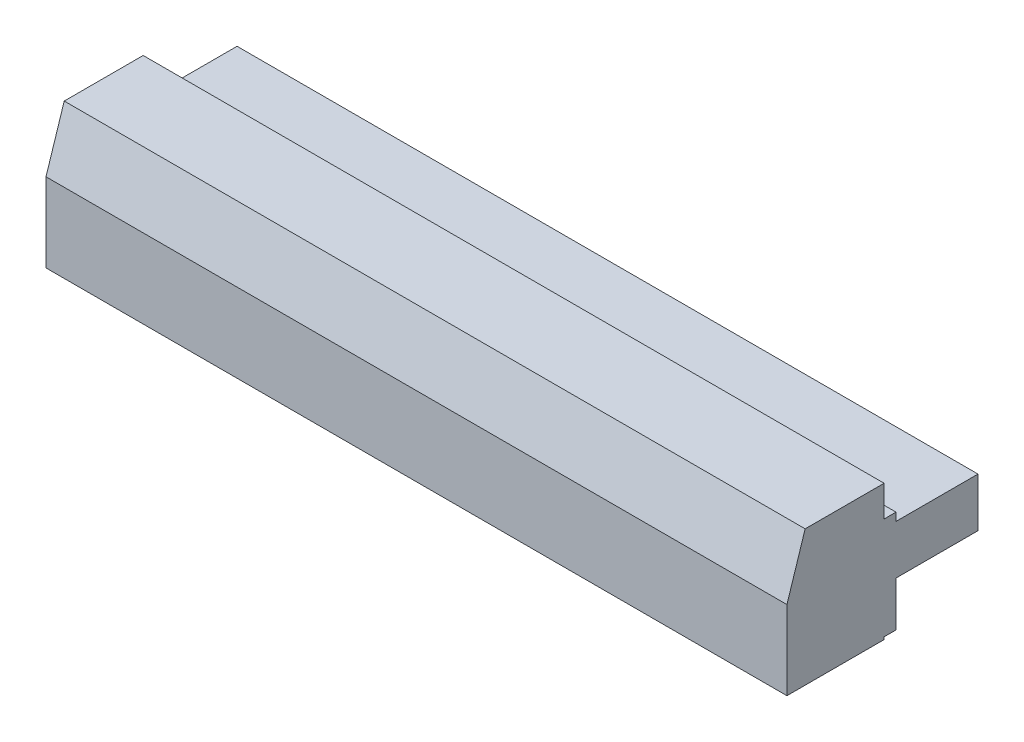
ISO-10303-21;
HEADER;
FILE_DESCRIPTION(('STEP AP214'),'2;1');
FILE_NAME('part.step','',(''),(''),'','','');
FILE_SCHEMA(('AUTOMOTIVE_DESIGN { 1 0 10303 214 1 1 1 1 }'));
ENDSEC;
DATA;
#1=APPLICATION_CONTEXT('core data for automotive mechanical design processes');
#2=APPLICATION_PROTOCOL_DEFINITION('international standard','automotive_design',2000,#1);
#3=PRODUCT_CONTEXT('',#1,'mechanical');
#4=PRODUCT('Part','Part','',(#3));
#5=PRODUCT_RELATED_PRODUCT_CATEGORY('part','',(#4));
#6=PRODUCT_DEFINITION_FORMATION('','',#4);
#7=PRODUCT_DEFINITION_CONTEXT('part definition',#1,'design');
#8=PRODUCT_DEFINITION('design','',#6,#7);
#9=PRODUCT_DEFINITION_SHAPE('','',#8);
#10=(LENGTH_UNIT() NAMED_UNIT(*) SI_UNIT(.MILLI.,.METRE.));
#11=(NAMED_UNIT(*) PLANE_ANGLE_UNIT() SI_UNIT($,.RADIAN.));
#12=(NAMED_UNIT(*) SI_UNIT($,.STERADIAN.) SOLID_ANGLE_UNIT());
#13=UNCERTAINTY_MEASURE_WITH_UNIT(LENGTH_MEASURE(1.E-05),#10,'distance_accuracy_value','');
#14=(GEOMETRIC_REPRESENTATION_CONTEXT(3) GLOBAL_UNCERTAINTY_ASSIGNED_CONTEXT((#13)) GLOBAL_UNIT_ASSIGNED_CONTEXT((#10,
#11,#12)) REPRESENTATION_CONTEXT('',''));
#15=CARTESIAN_POINT('',(0.,0.,0.));
#16=DIRECTION('',(0.,0.,1.));
#17=DIRECTION('',(1.,0.,0.));
#18=AXIS2_PLACEMENT_3D('',#15,#16,#17);
#19=CARTESIAN_POINT('',(61.,0.,-0.98));
#20=DIRECTION('',(0.,1.,0.));
#21=DIRECTION('',(0.,0.,1.));
#22=AXIS2_PLACEMENT_3D('',#19,#20,#21);
#23=PLANE('',#22);
#24=DIRECTION('',(0.,0.,-1.));
#25=VECTOR('',#24,1.);
#26=CARTESIAN_POINT('',(0.,0.,-0.98));
#27=LINE('',#26,#25);
#28=CARTESIAN_POINT('',(0.,0.,0.));
#29=VERTEX_POINT('',#28);
#30=CARTESIAN_POINT('',(0.,0.,-0.98));
#31=VERTEX_POINT('',#30);
#32=EDGE_CURVE('E162',#29,#31,#27,.T.);
#33=ORIENTED_EDGE('',*,*,#32,.T.);
#34=DIRECTION('',(-1.,0.,0.));
#35=VECTOR('',#34,1.);
#36=CARTESIAN_POINT('',(61.,0.,-0.98));
#37=LINE('',#36,#35);
#38=CARTESIAN_POINT('',(61.,0.,-0.98));
#39=VERTEX_POINT('',#38);
#40=EDGE_CURVE('E11',#39,#31,#37,.T.);
#41=ORIENTED_EDGE('',*,*,#40,.F.);
#42=DIRECTION('',(0.,0.,-1.));
#43=VECTOR('',#42,1.);
#44=CARTESIAN_POINT('',(61.,0.,-0.98));
#45=LINE('',#44,#43);
#46=CARTESIAN_POINT('',(61.,0.,0.));
#47=VERTEX_POINT('',#46);
#48=EDGE_CURVE('E186',#47,#39,#45,.T.);
#49=ORIENTED_EDGE('',*,*,#48,.F.);
#50=DIRECTION('',(-1.,0.,0.));
#51=VECTOR('',#50,1.);
#52=CARTESIAN_POINT('',(61.,0.,0.));
#53=LINE('',#52,#51);
#54=EDGE_CURVE('E158',#47,#29,#53,.T.);
#55=ORIENTED_EDGE('',*,*,#54,.T.);
#56=EDGE_LOOP('',(#33,#41,#49,#55));
#57=FACE_BOUND('',#56,.T.);
#58=ADVANCED_FACE('F36',(#57),#23,.F.);
#59=CARTESIAN_POINT('',(61.,3.7,-0.979999999999999));
#60=DIRECTION('',(0.,0.,1.));
#61=DIRECTION('',(0.,-1.,0.));
#62=AXIS2_PLACEMENT_3D('',#59,#60,#61);
#63=PLANE('',#62);
#64=DIRECTION('',(0.,1.,0.));
#65=VECTOR('',#64,1.);
#66=CARTESIAN_POINT('',(0.,3.7,-0.979999999999999));
#67=LINE('',#66,#65);
#68=CARTESIAN_POINT('',(0.,3.7,-0.979999999999999));
#69=VERTEX_POINT('',#68);
#70=EDGE_CURVE('E165',#31,#69,#67,.T.);
#71=ORIENTED_EDGE('',*,*,#70,.T.);
#72=DIRECTION('',(-1.,0.,0.));
#73=VECTOR('',#72,1.);
#74=CARTESIAN_POINT('',(61.,3.7,-0.979999999999999));
#75=LINE('',#74,#73);
#76=CARTESIAN_POINT('',(61.,3.7,-0.979999999999999));
#77=VERTEX_POINT('',#76);
#78=EDGE_CURVE('E44',#77,#69,#75,.T.);
#79=ORIENTED_EDGE('',*,*,#78,.F.);
#80=DIRECTION('',(0.,1.,0.));
#81=VECTOR('',#80,1.);
#82=CARTESIAN_POINT('',(61.,3.7,-0.979999999999999));
#83=LINE('',#82,#81);
#84=EDGE_CURVE('E110',#39,#77,#83,.T.);
#85=ORIENTED_EDGE('',*,*,#84,.F.);
#86=ORIENTED_EDGE('',*,*,#40,.T.);
#87=EDGE_LOOP('',(#71,#79,#85,#86));
#88=FACE_BOUND('',#87,.T.);
#89=ADVANCED_FACE('F269',(#88),#63,.F.);
#90=CARTESIAN_POINT('',(61.,3.7,-7.73));
#91=DIRECTION('',(0.,1.,0.));
#92=DIRECTION('',(0.,0.,1.));
#93=AXIS2_PLACEMENT_3D('',#90,#91,#92);
#94=PLANE('',#93);
#95=DIRECTION('',(0.,0.,-1.));
#96=VECTOR('',#95,1.);
#97=CARTESIAN_POINT('',(0.,3.7,-7.73));
#98=LINE('',#97,#96);
#99=CARTESIAN_POINT('',(0.,3.7,-7.73));
#100=VERTEX_POINT('',#99);
#101=EDGE_CURVE('E167',#69,#100,#98,.T.);
#102=ORIENTED_EDGE('',*,*,#101,.T.);
#103=DIRECTION('',(-1.,0.,0.));
#104=VECTOR('',#103,1.);
#105=CARTESIAN_POINT('',(61.,3.7,-7.73));
#106=LINE('',#105,#104);
#107=CARTESIAN_POINT('',(61.,3.7,-7.73));
#108=VERTEX_POINT('',#107);
#109=EDGE_CURVE('E208',#108,#100,#106,.T.);
#110=ORIENTED_EDGE('',*,*,#109,.F.);
#111=DIRECTION('',(0.,0.,-1.));
#112=VECTOR('',#111,1.);
#113=CARTESIAN_POINT('',(61.,3.7,-7.73));
#114=LINE('',#113,#112);
#115=EDGE_CURVE('E216',#77,#108,#114,.T.);
#116=ORIENTED_EDGE('',*,*,#115,.F.);
#117=ORIENTED_EDGE('',*,*,#78,.T.);
#118=EDGE_LOOP('',(#102,#110,#116,#117));
#119=FACE_BOUND('',#118,.T.);
#120=ADVANCED_FACE('F214',(#119),#94,.F.);
#121=CARTESIAN_POINT('',(61.,7.74,-7.73));
#122=DIRECTION('',(0.,0.,1.));
#123=DIRECTION('',(0.,-1.,0.));
#124=AXIS2_PLACEMENT_3D('',#121,#122,#123);
#125=PLANE('',#124);
#126=DIRECTION('',(0.,1.,0.));
#127=VECTOR('',#126,1.);
#128=CARTESIAN_POINT('',(0.,7.74,-7.73));
#129=LINE('',#128,#127);
#130=CARTESIAN_POINT('',(0.,7.74,-7.73));
#131=VERTEX_POINT('',#130);
#132=EDGE_CURVE('E169',#100,#131,#129,.T.);
#133=ORIENTED_EDGE('',*,*,#132,.T.);
#134=DIRECTION('',(-1.,0.,0.));
#135=VECTOR('',#134,1.);
#136=CARTESIAN_POINT('',(61.,7.74,-7.73));
#137=LINE('',#136,#135);
#138=CARTESIAN_POINT('',(61.,7.74,-7.73));
#139=VERTEX_POINT('',#138);
#140=EDGE_CURVE('E205',#139,#131,#137,.T.);
#141=ORIENTED_EDGE('',*,*,#140,.F.);
#142=DIRECTION('',(0.,1.,0.));
#143=VECTOR('',#142,1.);
#144=CARTESIAN_POINT('',(61.,7.74,-7.73));
#145=LINE('',#144,#143);
#146=EDGE_CURVE('E234',#108,#139,#145,.T.);
#147=ORIENTED_EDGE('',*,*,#146,.F.);
#148=ORIENTED_EDGE('',*,*,#109,.T.);
#149=EDGE_LOOP('',(#133,#141,#147,#148));
#150=FACE_BOUND('',#149,.T.);
#151=ADVANCED_FACE('F225',(#150),#125,.F.);
#152=CARTESIAN_POINT('',(61.,7.74,-0.979999999999999));
#153=DIRECTION('',(0.,-1.,0.));
#154=DIRECTION('',(0.,0.,-1.));
#155=AXIS2_PLACEMENT_3D('',#152,#153,#154);
#156=PLANE('',#155);
#157=DIRECTION('',(0.,0.,1.));
#158=VECTOR('',#157,1.);
#159=CARTESIAN_POINT('',(0.,7.74,-0.979999999999999));
#160=LINE('',#159,#158);
#161=CARTESIAN_POINT('',(0.,7.74,-0.979999999999999));
#162=VERTEX_POINT('',#161);
#163=EDGE_CURVE('E171',#131,#162,#160,.T.);
#164=ORIENTED_EDGE('',*,*,#163,.T.);
#165=DIRECTION('',(-1.,0.,0.));
#166=VECTOR('',#165,1.);
#167=CARTESIAN_POINT('',(61.,7.74,-0.979999999999999));
#168=LINE('',#167,#166);
#169=CARTESIAN_POINT('',(61.,7.74,-0.979999999999999));
#170=VERTEX_POINT('',#169);
#171=EDGE_CURVE('E202',#170,#162,#168,.T.);
#172=ORIENTED_EDGE('',*,*,#171,.F.);
#173=DIRECTION('',(0.,0.,1.));
#174=VECTOR('',#173,1.);
#175=CARTESIAN_POINT('',(61.,7.74,-0.979999999999999));
#176=LINE('',#175,#174);
#177=EDGE_CURVE('E231',#139,#170,#176,.T.);
#178=ORIENTED_EDGE('',*,*,#177,.F.);
#179=ORIENTED_EDGE('',*,*,#140,.T.);
#180=EDGE_LOOP('',(#164,#172,#178,#179));
#181=FACE_BOUND('',#180,.T.);
#182=ADVANCED_FACE('F229',(#181),#156,.F.);
#183=CARTESIAN_POINT('',(61.,8.4,-0.979999999999999));
#184=DIRECTION('',(0.,0.,1.));
#185=DIRECTION('',(0.,-1.,0.));
#186=AXIS2_PLACEMENT_3D('',#183,#184,#185);
#187=PLANE('',#186);
#188=DIRECTION('',(0.,1.,0.));
#189=VECTOR('',#188,1.);
#190=CARTESIAN_POINT('',(0.,8.4,-0.979999999999999));
#191=LINE('',#190,#189);
#192=CARTESIAN_POINT('',(0.,8.4,-0.979999999999999));
#193=VERTEX_POINT('',#192);
#194=EDGE_CURVE('E173',#162,#193,#191,.T.);
#195=ORIENTED_EDGE('',*,*,#194,.T.);
#196=DIRECTION('',(-1.,0.,0.));
#197=VECTOR('',#196,1.);
#198=CARTESIAN_POINT('',(61.,8.4,-0.979999999999999));
#199=LINE('',#198,#197);
#200=CARTESIAN_POINT('',(61.,8.4,-0.979999999999999));
#201=VERTEX_POINT('',#200);
#202=EDGE_CURVE('E199',#201,#193,#199,.T.);
#203=ORIENTED_EDGE('',*,*,#202,.F.);
#204=DIRECTION('',(0.,1.,0.));
#205=VECTOR('',#204,1.);
#206=CARTESIAN_POINT('',(61.,8.4,-0.979999999999999));
#207=LINE('',#206,#205);
#208=EDGE_CURVE('E233',#170,#201,#207,.T.);
#209=ORIENTED_EDGE('',*,*,#208,.F.);
#210=ORIENTED_EDGE('',*,*,#171,.T.);
#211=EDGE_LOOP('',(#195,#203,#209,#210));
#212=FACE_BOUND('',#211,.T.);
#213=ADVANCED_FACE('F282',(#212),#187,.F.);
#214=CARTESIAN_POINT('',(61.,8.4,0.));
#215=DIRECTION('',(0.,-1.,0.));
#216=DIRECTION('',(0.,0.,-1.));
#217=AXIS2_PLACEMENT_3D('',#214,#215,#216);
#218=PLANE('',#217);
#219=DIRECTION('',(0.,0.,1.));
#220=VECTOR('',#219,1.);
#221=CARTESIAN_POINT('',(0.,8.4,0.));
#222=LINE('',#221,#220);
#223=CARTESIAN_POINT('',(0.,8.4,0.));
#224=VERTEX_POINT('',#223);
#225=EDGE_CURVE('E175',#193,#224,#222,.T.);
#226=ORIENTED_EDGE('',*,*,#225,.T.);
#227=DIRECTION('',(-1.,0.,0.));
#228=VECTOR('',#227,1.);
#229=CARTESIAN_POINT('',(61.,8.4,0.));
#230=LINE('',#229,#228);
#231=CARTESIAN_POINT('',(61.,8.4,0.));
#232=VERTEX_POINT('',#231);
#233=EDGE_CURVE('E196',#232,#224,#230,.T.);
#234=ORIENTED_EDGE('',*,*,#233,.F.);
#235=DIRECTION('',(0.,0.,1.));
#236=VECTOR('',#235,1.);
#237=CARTESIAN_POINT('',(61.,8.4,0.));
#238=LINE('',#237,#236);
#239=EDGE_CURVE('E236',#201,#232,#238,.T.);
#240=ORIENTED_EDGE('',*,*,#239,.F.);
#241=ORIENTED_EDGE('',*,*,#202,.T.);
#242=EDGE_LOOP('',(#226,#234,#240,#241));
#243=FACE_BOUND('',#242,.T.);
#244=ADVANCED_FACE('F285',(#243),#218,.F.);
#245=CARTESIAN_POINT('',(61.,10.95,0.));
#246=DIRECTION('',(0.,0.,1.));
#247=DIRECTION('',(0.,-1.,0.));
#248=AXIS2_PLACEMENT_3D('',#245,#246,#247);
#249=PLANE('',#248);
#250=DIRECTION('',(0.,1.,0.));
#251=VECTOR('',#250,1.);
#252=CARTESIAN_POINT('',(0.,10.95,0.));
#253=LINE('',#252,#251);
#254=CARTESIAN_POINT('',(0.,10.95,0.));
#255=VERTEX_POINT('',#254);
#256=EDGE_CURVE('E177',#224,#255,#253,.T.);
#257=ORIENTED_EDGE('',*,*,#256,.T.);
#258=DIRECTION('',(-1.,0.,0.));
#259=VECTOR('',#258,1.);
#260=CARTESIAN_POINT('',(61.,10.95,0.));
#261=LINE('',#260,#259);
#262=CARTESIAN_POINT('',(61.,10.95,0.));
#263=VERTEX_POINT('',#262);
#264=EDGE_CURVE('E193',#263,#255,#261,.T.);
#265=ORIENTED_EDGE('',*,*,#264,.F.);
#266=DIRECTION('',(0.,1.,0.));
#267=VECTOR('',#266,1.);
#268=CARTESIAN_POINT('',(61.,10.95,0.));
#269=LINE('',#268,#267);
#270=EDGE_CURVE('E242',#232,#263,#269,.T.);
#271=ORIENTED_EDGE('',*,*,#270,.F.);
#272=ORIENTED_EDGE('',*,*,#233,.T.);
#273=EDGE_LOOP('',(#257,#265,#271,#272));
#274=FACE_BOUND('',#273,.T.);
#275=ADVANCED_FACE('F289',(#274),#249,.F.);
#276=CARTESIAN_POINT('',(61.,10.95,6.5));
#277=DIRECTION('',(0.,-1.,0.));
#278=DIRECTION('',(0.,0.,-1.));
#279=AXIS2_PLACEMENT_3D('',#276,#277,#278);
#280=PLANE('',#279);
#281=DIRECTION('',(0.,0.,1.));
#282=VECTOR('',#281,1.);
#283=CARTESIAN_POINT('',(0.,10.95,6.5));
#284=LINE('',#283,#282);
#285=CARTESIAN_POINT('',(0.,10.95,6.5));
#286=VERTEX_POINT('',#285);
#287=EDGE_CURVE('E179',#255,#286,#284,.T.);
#288=ORIENTED_EDGE('',*,*,#287,.T.);
#289=DIRECTION('',(-1.,0.,0.));
#290=VECTOR('',#289,1.);
#291=CARTESIAN_POINT('',(61.,10.95,6.5));
#292=LINE('',#291,#290);
#293=CARTESIAN_POINT('',(61.,10.95,6.5));
#294=VERTEX_POINT('',#293);
#295=EDGE_CURVE('E190',#294,#286,#292,.T.);
#296=ORIENTED_EDGE('',*,*,#295,.F.);
#297=DIRECTION('',(0.,0.,1.));
#298=VECTOR('',#297,1.);
#299=CARTESIAN_POINT('',(61.,10.95,6.5));
#300=LINE('',#299,#298);
#301=EDGE_CURVE('E244',#263,#294,#300,.T.);
#302=ORIENTED_EDGE('',*,*,#301,.F.);
#303=ORIENTED_EDGE('',*,*,#264,.T.);
#304=EDGE_LOOP('',(#288,#296,#302,#303));
#305=FACE_BOUND('',#304,.T.);
#306=ADVANCED_FACE('F250',(#305),#280,.F.);
#307=CARTESIAN_POINT('',(61.,6.3,8.));
#308=DIRECTION('',(0.,-0.307002779922758,-0.951708617760551));
#309=DIRECTION('',(0.,0.951708617760551,-0.307002779922758));
#310=AXIS2_PLACEMENT_3D('',#307,#308,#309);
#311=PLANE('',#310);
#312=DIRECTION('',(0.,-0.951708617760551,0.307002779922758));
#313=VECTOR('',#312,1.);
#314=CARTESIAN_POINT('',(0.,6.3,8.));
#315=LINE('',#314,#313);
#316=CARTESIAN_POINT('',(0.,6.3,8.));
#317=VERTEX_POINT('',#316);
#318=EDGE_CURVE('E181',#286,#317,#315,.T.);
#319=ORIENTED_EDGE('',*,*,#318,.T.);
#320=DIRECTION('',(-1.,0.,0.));
#321=VECTOR('',#320,1.);
#322=CARTESIAN_POINT('',(61.,6.3,8.));
#323=LINE('',#322,#321);
#324=CARTESIAN_POINT('',(61.,6.3,8.));
#325=VERTEX_POINT('',#324);
#326=EDGE_CURVE('E153',#325,#317,#323,.T.);
#327=ORIENTED_EDGE('',*,*,#326,.F.);
#328=DIRECTION('',(0.,-0.951708617760551,0.307002779922758));
#329=VECTOR('',#328,1.);
#330=CARTESIAN_POINT('',(61.,6.3,8.));
#331=LINE('',#330,#329);
#332=EDGE_CURVE('E144',#294,#325,#331,.T.);
#333=ORIENTED_EDGE('',*,*,#332,.F.);
#334=ORIENTED_EDGE('',*,*,#295,.T.);
#335=EDGE_LOOP('',(#319,#327,#333,#334));
#336=FACE_BOUND('',#335,.T.);
#337=ADVANCED_FACE('F254',(#336),#311,.F.);
#338=CARTESIAN_POINT('',(61.,-0.200000000000001,8.));
#339=DIRECTION('',(0.,0.,-1.));
#340=DIRECTION('',(-1.,0.,0.));
#341=AXIS2_PLACEMENT_3D('',#338,#339,#340);
#342=PLANE('',#341);
#343=DIRECTION('',(0.,-1.,0.));
#344=VECTOR('',#343,1.);
#345=CARTESIAN_POINT('',(0.,-0.200000000000001,8.));
#346=LINE('',#345,#344);
#347=CARTESIAN_POINT('',(0.,-0.200000000000001,8.));
#348=VERTEX_POINT('',#347);
#349=EDGE_CURVE('E152',#317,#348,#346,.T.);
#350=ORIENTED_EDGE('',*,*,#349,.T.);
#351=DIRECTION('',(-1.,0.,0.));
#352=VECTOR('',#351,1.);
#353=CARTESIAN_POINT('',(61.,-0.200000000000001,8.));
#354=LINE('',#353,#352);
#355=CARTESIAN_POINT('',(61.,-0.200000000000001,8.));
#356=VERTEX_POINT('',#355);
#357=EDGE_CURVE('E149',#356,#348,#354,.T.);
#358=ORIENTED_EDGE('',*,*,#357,.F.);
#359=DIRECTION('',(0.,-1.,0.));
#360=VECTOR('',#359,1.);
#361=CARTESIAN_POINT('',(61.,-0.200000000000001,8.));
#362=LINE('',#361,#360);
#363=EDGE_CURVE('E138',#325,#356,#362,.T.);
#364=ORIENTED_EDGE('',*,*,#363,.F.);
#365=ORIENTED_EDGE('',*,*,#326,.T.);
#366=EDGE_LOOP('',(#350,#358,#364,#365));
#367=FACE_BOUND('',#366,.T.);
#368=ADVANCED_FACE('F150',(#367),#342,.F.);
#369=CARTESIAN_POINT('',(61.,-0.2,0.));
#370=DIRECTION('',(0.,1.,0.));
#371=DIRECTION('',(0.,0.,1.));
#372=AXIS2_PLACEMENT_3D('',#369,#370,#371);
#373=PLANE('',#372);
#374=DIRECTION('',(0.,0.,-1.));
#375=VECTOR('',#374,1.);
#376=CARTESIAN_POINT('',(0.,-0.2,0.));
#377=LINE('',#376,#375);
#378=CARTESIAN_POINT('',(0.,-0.2,0.));
#379=VERTEX_POINT('',#378);
#380=EDGE_CURVE('E96',#348,#379,#377,.T.);
#381=ORIENTED_EDGE('',*,*,#380,.T.);
#382=DIRECTION('',(-1.,0.,0.));
#383=VECTOR('',#382,1.);
#384=CARTESIAN_POINT('',(61.,-0.2,0.));
#385=LINE('',#384,#383);
#386=CARTESIAN_POINT('',(61.,-0.2,0.));
#387=VERTEX_POINT('',#386);
#388=EDGE_CURVE('E154',#387,#379,#385,.T.);
#389=ORIENTED_EDGE('',*,*,#388,.F.);
#390=DIRECTION('',(0.,0.,-1.));
#391=VECTOR('',#390,1.);
#392=CARTESIAN_POINT('',(61.,-0.2,0.));
#393=LINE('',#392,#391);
#394=EDGE_CURVE('E142',#356,#387,#393,.T.);
#395=ORIENTED_EDGE('',*,*,#394,.F.);
#396=ORIENTED_EDGE('',*,*,#357,.T.);
#397=EDGE_LOOP('',(#381,#389,#395,#396));
#398=FACE_BOUND('',#397,.T.);
#399=ADVANCED_FACE('F156',(#398),#373,.F.);
#400=CARTESIAN_POINT('',(61.,0.,0.));
#401=DIRECTION('',(0.,0.,1.));
#402=DIRECTION('',(0.,-1.,0.));
#403=AXIS2_PLACEMENT_3D('',#400,#401,#402);
#404=PLANE('',#403);
#405=DIRECTION('',(0.,1.,0.));
#406=VECTOR('',#405,1.);
#407=CARTESIAN_POINT('',(0.,0.,0.));
#408=LINE('',#407,#406);
#409=EDGE_CURVE('E102',#379,#29,#408,.T.);
#410=ORIENTED_EDGE('',*,*,#409,.T.);
#411=ORIENTED_EDGE('',*,*,#54,.F.);
#412=DIRECTION('',(0.,1.,0.));
#413=VECTOR('',#412,1.);
#414=CARTESIAN_POINT('',(61.,0.,0.));
#415=LINE('',#414,#413);
#416=EDGE_CURVE('E52',#387,#47,#415,.T.);
#417=ORIENTED_EDGE('',*,*,#416,.F.);
#418=ORIENTED_EDGE('',*,*,#388,.T.);
#419=EDGE_LOOP('',(#410,#411,#417,#418));
#420=FACE_BOUND('',#419,.T.);
#421=ADVANCED_FACE('F258',(#420),#404,.F.);
#422=CARTESIAN_POINT('',(61.,0.,0.));
#423=DIRECTION('',(1.,0.,0.));
#424=DIRECTION('',(0.,0.,-1.));
#425=AXIS2_PLACEMENT_3D('',#422,#423,#424);
#426=PLANE('',#425);
#427=ORIENTED_EDGE('',*,*,#48,.T.);
#428=ORIENTED_EDGE('',*,*,#84,.T.);
#429=ORIENTED_EDGE('',*,*,#115,.T.);
#430=ORIENTED_EDGE('',*,*,#146,.T.);
#431=ORIENTED_EDGE('',*,*,#177,.T.);
#432=ORIENTED_EDGE('',*,*,#208,.T.);
#433=ORIENTED_EDGE('',*,*,#239,.T.);
#434=ORIENTED_EDGE('',*,*,#270,.T.);
#435=ORIENTED_EDGE('',*,*,#301,.T.);
#436=ORIENTED_EDGE('',*,*,#332,.T.);
#437=ORIENTED_EDGE('',*,*,#363,.T.);
#438=ORIENTED_EDGE('',*,*,#394,.T.);
#439=ORIENTED_EDGE('',*,*,#416,.T.);
#440=EDGE_LOOP('',(#427,#428,#429,#430,#431,#432,#433,#434,#435,#436,#437,#438,#439));
#441=FACE_BOUND('',#440,.T.);
#442=ADVANCED_FACE('F140',(#441),#426,.T.);
#443=CARTESIAN_POINT('',(0.,0.,0.));
#444=DIRECTION('',(1.,0.,0.));
#445=DIRECTION('',(0.,0.,-1.));
#446=AXIS2_PLACEMENT_3D('',#443,#444,#445);
#447=PLANE('',#446);
#448=ORIENTED_EDGE('',*,*,#32,.F.);
#449=ORIENTED_EDGE('',*,*,#409,.F.);
#450=ORIENTED_EDGE('',*,*,#380,.F.);
#451=ORIENTED_EDGE('',*,*,#349,.F.);
#452=ORIENTED_EDGE('',*,*,#318,.F.);
#453=ORIENTED_EDGE('',*,*,#287,.F.);
#454=ORIENTED_EDGE('',*,*,#256,.F.);
#455=ORIENTED_EDGE('',*,*,#225,.F.);
#456=ORIENTED_EDGE('',*,*,#194,.F.);
#457=ORIENTED_EDGE('',*,*,#163,.F.);
#458=ORIENTED_EDGE('',*,*,#132,.F.);
#459=ORIENTED_EDGE('',*,*,#101,.F.);
#460=ORIENTED_EDGE('',*,*,#70,.F.);
#461=EDGE_LOOP('',(#448,#449,#450,#451,#452,#453,#454,#455,#456,#457,#458,#459,#460));
#462=FACE_BOUND('',#461,.T.);
#463=ADVANCED_FACE('F220',(#462),#447,.F.);
#464=CLOSED_SHELL('',(#58,#89,#120,#151,#182,#213,#244,#275,#306,#337,#368,#399,#421,#442,#463));
#465=MANIFOLD_SOLID_BREP('B2',#464);
#466=ADVANCED_BREP_SHAPE_REPRESENTATION('',(#18,#465),#14);
#467=SHAPE_DEFINITION_REPRESENTATION(#9,#466);
ENDSEC;
END-ISO-10303-21;
